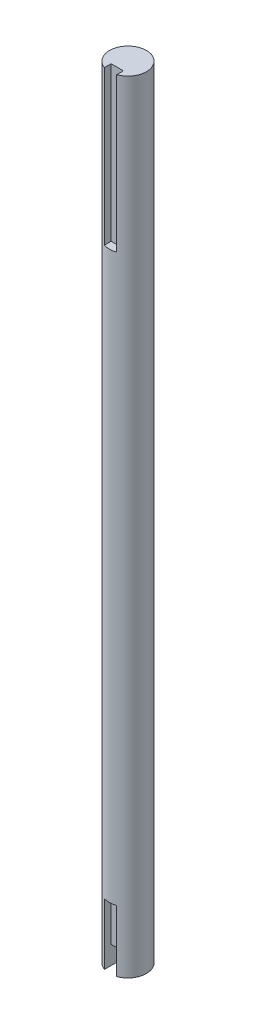
ISO-10303-21;
HEADER;
FILE_DESCRIPTION(('STEP AP214'),'2;1');
FILE_NAME('part.step','',(''),(''),'','','');
FILE_SCHEMA(('AUTOMOTIVE_DESIGN { 1 0 10303 214 1 1 1 1 }'));
ENDSEC;
DATA;
#1=APPLICATION_CONTEXT('core data for automotive mechanical design processes');
#2=APPLICATION_PROTOCOL_DEFINITION('international standard','automotive_design',2000,#1);
#3=PRODUCT_CONTEXT('',#1,'mechanical');
#4=PRODUCT('Part','Part','',(#3));
#5=PRODUCT_RELATED_PRODUCT_CATEGORY('part','',(#4));
#6=PRODUCT_DEFINITION_FORMATION('','',#4);
#7=PRODUCT_DEFINITION_CONTEXT('part definition',#1,'design');
#8=PRODUCT_DEFINITION('design','',#6,#7);
#9=PRODUCT_DEFINITION_SHAPE('','',#8);
#10=(LENGTH_UNIT() NAMED_UNIT(*) SI_UNIT(.MILLI.,.METRE.));
#11=(NAMED_UNIT(*) PLANE_ANGLE_UNIT() SI_UNIT($,.RADIAN.));
#12=(NAMED_UNIT(*) SI_UNIT($,.STERADIAN.) SOLID_ANGLE_UNIT());
#13=UNCERTAINTY_MEASURE_WITH_UNIT(LENGTH_MEASURE(1.E-05),#10,'distance_accuracy_value','');
#14=(GEOMETRIC_REPRESENTATION_CONTEXT(3) GLOBAL_UNCERTAINTY_ASSIGNED_CONTEXT((#13)) GLOBAL_UNIT_ASSIGNED_CONTEXT((#10,
#11,#12)) REPRESENTATION_CONTEXT('',''));
#15=CARTESIAN_POINT('',(0.,0.,0.));
#16=DIRECTION('',(0.,0.,1.));
#17=DIRECTION('',(1.,0.,0.));
#18=AXIS2_PLACEMENT_3D('',#15,#16,#17);
#19=CARTESIAN_POINT('',(0.,0.,0.));
#20=DIRECTION('',(0.,1.,0.));
#21=DIRECTION('',(0.,0.,1.));
#22=AXIS2_PLACEMENT_3D('',#19,#20,#21);
#23=PLANE('',#22);
#24=DIRECTION('',(0.,0.,1.));
#25=VECTOR('',#24,1.);
#26=CARTESIAN_POINT('',(2.,0.,0.));
#27=LINE('',#26,#25);
#28=CARTESIAN_POINT('',(2.,0.,1.));
#29=VERTEX_POINT('',#28);
#30=CARTESIAN_POINT('',(2.,0.,5.65685424949238));
#31=VERTEX_POINT('',#30);
#32=EDGE_CURVE('E185',#29,#31,#27,.T.);
#33=ORIENTED_EDGE('',*,*,#32,.F.);
#34=DIRECTION('',(-1.,0.,0.));
#35=VECTOR('',#34,1.);
#36=CARTESIAN_POINT('',(-2.,0.,0.999999999999999));
#37=LINE('',#36,#35);
#38=CARTESIAN_POINT('',(-2.,0.,0.999999999999999));
#39=VERTEX_POINT('',#38);
#40=EDGE_CURVE('E123',#29,#39,#37,.T.);
#41=ORIENTED_EDGE('',*,*,#40,.T.);
#42=DIRECTION('',(0.,0.,-1.));
#43=VECTOR('',#42,1.);
#44=CARTESIAN_POINT('',(-2.,0.,0.));
#45=LINE('',#44,#43);
#46=CARTESIAN_POINT('',(-2.,0.,5.65685424949238));
#47=VERTEX_POINT('',#46);
#48=EDGE_CURVE('E181',#47,#39,#45,.T.);
#49=ORIENTED_EDGE('',*,*,#48,.F.);
#50=CARTESIAN_POINT('',(0.,0.,0.));
#51=DIRECTION('',(0.,1.,0.));
#52=DIRECTION('',(0.,0.,1.));
#53=AXIS2_PLACEMENT_3D('',#50,#51,#52);
#54=CIRCLE('',#53,6.);
#55=EDGE_CURVE('E177',#31,#47,#54,.T.);
#56=ORIENTED_EDGE('',*,*,#55,.F.);
#57=EDGE_LOOP('',(#33,#41,#49,#56));
#58=FACE_BOUND('',#57,.T.);
#59=ADVANCED_FACE('F38',(#58),#23,.F.);
#60=CARTESIAN_POINT('',(-2.,20.,3.5));
#61=DIRECTION('',(0.,0.,1.));
#62=DIRECTION('',(1.,0.,0.));
#63=AXIS2_PLACEMENT_3D('',#60,#61,#62);
#64=PLANE('',#63);
#65=DIRECTION('',(0.,-1.,0.));
#66=VECTOR('',#65,1.);
#67=CARTESIAN_POINT('',(-2.,20.,3.5));
#68=LINE('',#67,#66);
#69=CARTESIAN_POINT('',(-2.,20.,3.5));
#70=VERTEX_POINT('',#69);
#71=CARTESIAN_POINT('',(-2.,6.,3.5));
#72=VERTEX_POINT('',#71);
#73=EDGE_CURVE('E169',#70,#72,#68,.T.);
#74=ORIENTED_EDGE('',*,*,#73,.T.);
#75=DIRECTION('',(1.,0.,0.));
#76=VECTOR('',#75,1.);
#77=CARTESIAN_POINT('',(-2.,6.,3.5));
#78=LINE('',#77,#76);
#79=CARTESIAN_POINT('',(2.,6.,3.5));
#80=VERTEX_POINT('',#79);
#81=EDGE_CURVE('E136',#72,#80,#78,.T.);
#82=ORIENTED_EDGE('',*,*,#81,.T.);
#83=DIRECTION('',(0.,-1.,0.));
#84=VECTOR('',#83,1.);
#85=CARTESIAN_POINT('',(2.,20.,3.5));
#86=LINE('',#85,#84);
#87=CARTESIAN_POINT('',(2.,20.,3.5));
#88=VERTEX_POINT('',#87);
#89=EDGE_CURVE('E121',#88,#80,#86,.T.);
#90=ORIENTED_EDGE('',*,*,#89,.F.);
#91=DIRECTION('',(-1.,0.,0.));
#92=VECTOR('',#91,1.);
#93=CARTESIAN_POINT('',(-2.,20.,3.5));
#94=LINE('',#93,#92);
#95=EDGE_CURVE('E164',#88,#70,#94,.T.);
#96=ORIENTED_EDGE('',*,*,#95,.T.);
#97=EDGE_LOOP('',(#74,#82,#90,#96));
#98=FACE_BOUND('',#97,.T.);
#99=ADVANCED_FACE('F217',(#98),#64,.T.);
#100=CARTESIAN_POINT('',(0.,254.,0.));
#101=DIRECTION('',(0.,-1.,0.));
#102=DIRECTION('',(0.,0.,-1.));
#103=AXIS2_PLACEMENT_3D('',#100,#101,#102);
#104=CYLINDRICAL_SURFACE('',#103,6.);
#105=DIRECTION('',(0.,-1.,0.));
#106=VECTOR('',#105,1.);
#107=CARTESIAN_POINT('',(2.,254.,5.65685424949238));
#108=LINE('',#107,#106);
#109=CARTESIAN_POINT('',(2.,20.,5.65685424949238));
#110=VERTEX_POINT('',#109);
#111=EDGE_CURVE('E175',#31,#110,#108,.F.);
#112=ORIENTED_EDGE('',*,*,#111,.F.);
#113=ORIENTED_EDGE('',*,*,#55,.T.);
#114=DIRECTION('',(0.,-1.,0.));
#115=VECTOR('',#114,1.);
#116=CARTESIAN_POINT('',(-2.,254.,5.65685424949238));
#117=LINE('',#116,#115);
#118=CARTESIAN_POINT('',(-2.,20.,5.65685424949238));
#119=VERTEX_POINT('',#118);
#120=EDGE_CURVE('E173',#119,#47,#117,.T.);
#121=ORIENTED_EDGE('',*,*,#120,.F.);
#122=CARTESIAN_POINT('',(0.,20.,0.));
#123=DIRECTION('',(0.,-1.,0.));
#124=DIRECTION('',(0.,0.,-1.));
#125=AXIS2_PLACEMENT_3D('',#122,#123,#124);
#126=CIRCLE('',#125,6.);
#127=EDGE_CURVE('E187',#110,#119,#126,.T.);
#128=ORIENTED_EDGE('',*,*,#127,.F.);
#129=EDGE_LOOP('',(#112,#113,#121,#128));
#130=FACE_BOUND('',#129,.T.);
#131=DIRECTION('',(0.,-1.,0.));
#132=VECTOR('',#131,1.);
#133=CARTESIAN_POINT('',(-2.,254.,5.65685424949238));
#134=LINE('',#133,#132);
#135=CARTESIAN_POINT('',(-2.,254.,5.65685424949238));
#136=VERTEX_POINT('',#135);
#137=CARTESIAN_POINT('',(-2.,204.,5.65685424949238));
#138=VERTEX_POINT('',#137);
#139=EDGE_CURVE('E160',#136,#138,#134,.T.);
#140=ORIENTED_EDGE('',*,*,#139,.F.);
#141=CARTESIAN_POINT('',(0.,254.,0.));
#142=DIRECTION('',(0.,1.,0.));
#143=DIRECTION('',(0.,0.,1.));
#144=AXIS2_PLACEMENT_3D('',#141,#142,#143);
#145=CIRCLE('',#144,6.);
#146=CARTESIAN_POINT('',(2.,254.,5.65685424949238));
#147=VERTEX_POINT('',#146);
#148=EDGE_CURVE('E178',#147,#136,#145,.T.);
#149=ORIENTED_EDGE('',*,*,#148,.F.);
#150=DIRECTION('',(0.,-1.,0.));
#151=VECTOR('',#150,1.);
#152=CARTESIAN_POINT('',(2.,254.,5.65685424949238));
#153=LINE('',#152,#151);
#154=CARTESIAN_POINT('',(2.,204.,5.65685424949238));
#155=VERTEX_POINT('',#154);
#156=EDGE_CURVE('E61',#155,#147,#153,.F.);
#157=ORIENTED_EDGE('',*,*,#156,.F.);
#158=CARTESIAN_POINT('',(0.,204.,0.));
#159=DIRECTION('',(0.,-1.,0.));
#160=DIRECTION('',(0.,0.,-1.));
#161=AXIS2_PLACEMENT_3D('',#158,#159,#160);
#162=CIRCLE('',#161,6.);
#163=EDGE_CURVE('E11',#155,#138,#162,.T.);
#164=ORIENTED_EDGE('',*,*,#163,.T.);
#165=EDGE_LOOP('',(#140,#149,#157,#164));
#166=FACE_BOUND('',#165,.T.);
#167=ADVANCED_FACE('F40',(#130,#166),#104,.T.);
#168=CARTESIAN_POINT('',(0.,254.,0.));
#169=DIRECTION('',(0.,1.,0.));
#170=DIRECTION('',(0.,0.,1.));
#171=AXIS2_PLACEMENT_3D('',#168,#169,#170);
#172=PLANE('',#171);
#173=ORIENTED_EDGE('',*,*,#148,.T.);
#174=DIRECTION('',(0.,0.,-1.));
#175=VECTOR('',#174,1.);
#176=CARTESIAN_POINT('',(-2.,254.,0.));
#177=LINE('',#176,#175);
#178=CARTESIAN_POINT('',(-2.,254.,3.5));
#179=VERTEX_POINT('',#178);
#180=EDGE_CURVE('E46',#136,#179,#177,.T.);
#181=ORIENTED_EDGE('',*,*,#180,.T.);
#182=DIRECTION('',(1.,0.,0.));
#183=VECTOR('',#182,1.);
#184=CARTESIAN_POINT('',(0.,254.,3.5));
#185=LINE('',#184,#183);
#186=CARTESIAN_POINT('',(2.,254.,3.5));
#187=VERTEX_POINT('',#186);
#188=EDGE_CURVE('E139',#179,#187,#185,.T.);
#189=ORIENTED_EDGE('',*,*,#188,.T.);
#190=DIRECTION('',(0.,0.,1.));
#191=VECTOR('',#190,1.);
#192=CARTESIAN_POINT('',(2.,254.,0.));
#193=LINE('',#192,#191);
#194=EDGE_CURVE('E147',#187,#147,#193,.T.);
#195=ORIENTED_EDGE('',*,*,#194,.T.);
#196=EDGE_LOOP('',(#173,#181,#189,#195));
#197=FACE_BOUND('',#196,.T.);
#198=ADVANCED_FACE('F190',(#197),#172,.T.);
#199=CARTESIAN_POINT('',(0.,20.,0.));
#200=DIRECTION('',(0.,-1.,0.));
#201=DIRECTION('',(0.,0.,-1.));
#202=AXIS2_PLACEMENT_3D('',#199,#200,#201);
#203=PLANE('',#202);
#204=ORIENTED_EDGE('',*,*,#127,.T.);
#205=DIRECTION('',(0.,0.,1.));
#206=VECTOR('',#205,1.);
#207=CARTESIAN_POINT('',(-2.,20.,8.5));
#208=LINE('',#207,#206);
#209=EDGE_CURVE('E166',#70,#119,#208,.T.);
#210=ORIENTED_EDGE('',*,*,#209,.F.);
#211=ORIENTED_EDGE('',*,*,#95,.F.);
#212=DIRECTION('',(0.,0.,-1.));
#213=VECTOR('',#212,1.);
#214=CARTESIAN_POINT('',(2.,20.,8.5));
#215=LINE('',#214,#213);
#216=EDGE_CURVE('E162',#110,#88,#215,.T.);
#217=ORIENTED_EDGE('',*,*,#216,.F.);
#218=EDGE_LOOP('',(#204,#210,#211,#217));
#219=FACE_BOUND('',#218,.T.);
#220=ADVANCED_FACE('F227',(#219),#203,.T.);
#221=CARTESIAN_POINT('',(2.,20.,8.5));
#222=DIRECTION('',(-1.,0.,0.));
#223=DIRECTION('',(0.,0.,1.));
#224=AXIS2_PLACEMENT_3D('',#221,#222,#223);
#225=PLANE('',#224);
#226=ORIENTED_EDGE('',*,*,#111,.T.);
#227=ORIENTED_EDGE('',*,*,#216,.T.);
#228=ORIENTED_EDGE('',*,*,#89,.T.);
#229=DIRECTION('',(0.,0.,-1.));
#230=VECTOR('',#229,1.);
#231=CARTESIAN_POINT('',(2.,6.,11.));
#232=LINE('',#231,#230);
#233=CARTESIAN_POINT('',(2.,6.,1.));
#234=VERTEX_POINT('',#233);
#235=EDGE_CURVE('E53',#80,#234,#232,.T.);
#236=ORIENTED_EDGE('',*,*,#235,.T.);
#237=DIRECTION('',(0.,-1.,0.));
#238=VECTOR('',#237,1.);
#239=CARTESIAN_POINT('',(2.,6.,1.));
#240=LINE('',#239,#238);
#241=EDGE_CURVE('E119',#234,#29,#240,.T.);
#242=ORIENTED_EDGE('',*,*,#241,.T.);
#243=ORIENTED_EDGE('',*,*,#32,.T.);
#244=EDGE_LOOP('',(#226,#227,#228,#236,#242,#243));
#245=FACE_BOUND('',#244,.T.);
#246=ADVANCED_FACE('F117',(#245),#225,.T.);
#247=CARTESIAN_POINT('',(-2.,20.,8.5));
#248=DIRECTION('',(1.,0.,0.));
#249=DIRECTION('',(0.,0.,-1.));
#250=AXIS2_PLACEMENT_3D('',#247,#248,#249);
#251=PLANE('',#250);
#252=ORIENTED_EDGE('',*,*,#48,.T.);
#253=DIRECTION('',(0.,-1.,0.));
#254=VECTOR('',#253,1.);
#255=CARTESIAN_POINT('',(-2.,6.,0.999999999999999));
#256=LINE('',#255,#254);
#257=CARTESIAN_POINT('',(-2.,6.,0.999999999999999));
#258=VERTEX_POINT('',#257);
#259=EDGE_CURVE('E137',#258,#39,#256,.T.);
#260=ORIENTED_EDGE('',*,*,#259,.F.);
#261=DIRECTION('',(0.,0.,1.));
#262=VECTOR('',#261,1.);
#263=CARTESIAN_POINT('',(-2.,6.,11.));
#264=LINE('',#263,#262);
#265=EDGE_CURVE('E128',#258,#72,#264,.T.);
#266=ORIENTED_EDGE('',*,*,#265,.T.);
#267=ORIENTED_EDGE('',*,*,#73,.F.);
#268=ORIENTED_EDGE('',*,*,#209,.T.);
#269=ORIENTED_EDGE('',*,*,#120,.T.);
#270=EDGE_LOOP('',(#252,#260,#266,#267,#268,#269));
#271=FACE_BOUND('',#270,.T.);
#272=ADVANCED_FACE('F229',(#271),#251,.T.);
#273=CARTESIAN_POINT('',(0.,204.,0.));
#274=DIRECTION('',(0.,-1.,0.));
#275=DIRECTION('',(0.,0.,-1.));
#276=AXIS2_PLACEMENT_3D('',#273,#274,#275);
#277=PLANE('',#276);
#278=DIRECTION('',(0.,0.,1.));
#279=VECTOR('',#278,1.);
#280=CARTESIAN_POINT('',(2.,204.,0.));
#281=LINE('',#280,#279);
#282=CARTESIAN_POINT('',(2.,204.,3.5));
#283=VERTEX_POINT('',#282);
#284=EDGE_CURVE('E149',#283,#155,#281,.T.);
#285=ORIENTED_EDGE('',*,*,#284,.F.);
#286=DIRECTION('',(1.,0.,0.));
#287=VECTOR('',#286,1.);
#288=CARTESIAN_POINT('',(0.,204.,3.5));
#289=LINE('',#288,#287);
#290=CARTESIAN_POINT('',(-2.,204.,3.5));
#291=VERTEX_POINT('',#290);
#292=EDGE_CURVE('E146',#291,#283,#289,.T.);
#293=ORIENTED_EDGE('',*,*,#292,.F.);
#294=DIRECTION('',(0.,0.,-1.));
#295=VECTOR('',#294,1.);
#296=CARTESIAN_POINT('',(-2.,204.,0.));
#297=LINE('',#296,#295);
#298=EDGE_CURVE('E144',#138,#291,#297,.T.);
#299=ORIENTED_EDGE('',*,*,#298,.F.);
#300=ORIENTED_EDGE('',*,*,#163,.F.);
#301=EDGE_LOOP('',(#285,#293,#299,#300));
#302=FACE_BOUND('',#301,.T.);
#303=ADVANCED_FACE('F200',(#302),#277,.F.);
#304=CARTESIAN_POINT('',(-2.,204.,0.));
#305=DIRECTION('',(1.,0.,0.));
#306=DIRECTION('',(0.,0.,-1.));
#307=AXIS2_PLACEMENT_3D('',#304,#305,#306);
#308=PLANE('',#307);
#309=ORIENTED_EDGE('',*,*,#139,.T.);
#310=ORIENTED_EDGE('',*,*,#298,.T.);
#311=DIRECTION('',(0.,1.,0.));
#312=VECTOR('',#311,1.);
#313=CARTESIAN_POINT('',(-2.,204.,3.5));
#314=LINE('',#313,#312);
#315=EDGE_CURVE('E156',#291,#179,#314,.T.);
#316=ORIENTED_EDGE('',*,*,#315,.T.);
#317=ORIENTED_EDGE('',*,*,#180,.F.);
#318=EDGE_LOOP('',(#309,#310,#316,#317));
#319=FACE_BOUND('',#318,.T.);
#320=ADVANCED_FACE('F194',(#319),#308,.T.);
#321=CARTESIAN_POINT('',(2.,204.,0.));
#322=DIRECTION('',(-1.,0.,0.));
#323=DIRECTION('',(0.,0.,1.));
#324=AXIS2_PLACEMENT_3D('',#321,#322,#323);
#325=PLANE('',#324);
#326=ORIENTED_EDGE('',*,*,#156,.T.);
#327=ORIENTED_EDGE('',*,*,#194,.F.);
#328=DIRECTION('',(0.,1.,0.));
#329=VECTOR('',#328,1.);
#330=CARTESIAN_POINT('',(2.,204.,3.5));
#331=LINE('',#330,#329);
#332=EDGE_CURVE('E151',#283,#187,#331,.T.);
#333=ORIENTED_EDGE('',*,*,#332,.F.);
#334=ORIENTED_EDGE('',*,*,#284,.T.);
#335=EDGE_LOOP('',(#326,#327,#333,#334));
#336=FACE_BOUND('',#335,.T.);
#337=ADVANCED_FACE('F203',(#336),#325,.T.);
#338=CARTESIAN_POINT('',(0.,204.,3.5));
#339=DIRECTION('',(0.,0.,1.));
#340=DIRECTION('',(1.,0.,0.));
#341=AXIS2_PLACEMENT_3D('',#338,#339,#340);
#342=PLANE('',#341);
#343=ORIENTED_EDGE('',*,*,#188,.F.);
#344=ORIENTED_EDGE('',*,*,#315,.F.);
#345=ORIENTED_EDGE('',*,*,#292,.T.);
#346=ORIENTED_EDGE('',*,*,#332,.T.);
#347=EDGE_LOOP('',(#343,#344,#345,#346));
#348=FACE_BOUND('',#347,.T.);
#349=ADVANCED_FACE('F205',(#348),#342,.T.);
#350=CARTESIAN_POINT('',(-2.,6.,0.999999999999999));
#351=DIRECTION('',(0.,0.,1.));
#352=DIRECTION('',(1.,0.,0.));
#353=AXIS2_PLACEMENT_3D('',#350,#351,#352);
#354=PLANE('',#353);
#355=ORIENTED_EDGE('',*,*,#40,.F.);
#356=ORIENTED_EDGE('',*,*,#241,.F.);
#357=DIRECTION('',(-1.,0.,0.));
#358=VECTOR('',#357,1.);
#359=CARTESIAN_POINT('',(-2.,6.,0.999999999999999));
#360=LINE('',#359,#358);
#361=EDGE_CURVE('E122',#234,#258,#360,.T.);
#362=ORIENTED_EDGE('',*,*,#361,.T.);
#363=ORIENTED_EDGE('',*,*,#259,.T.);
#364=EDGE_LOOP('',(#355,#356,#362,#363));
#365=FACE_BOUND('',#364,.T.);
#366=ADVANCED_FACE('F134',(#365),#354,.T.);
#367=CARTESIAN_POINT('',(0.,6.,0.));
#368=DIRECTION('',(0.,-1.,0.));
#369=DIRECTION('',(0.,0.,-1.));
#370=AXIS2_PLACEMENT_3D('',#367,#368,#369);
#371=PLANE('',#370);
#372=ORIENTED_EDGE('',*,*,#265,.F.);
#373=ORIENTED_EDGE('',*,*,#361,.F.);
#374=ORIENTED_EDGE('',*,*,#235,.F.);
#375=ORIENTED_EDGE('',*,*,#81,.F.);
#376=EDGE_LOOP('',(#372,#373,#374,#375));
#377=FACE_BOUND('',#376,.T.);
#378=ADVANCED_FACE('F126',(#377),#371,.T.);
#379=CLOSED_SHELL('',(#59,#99,#167,#198,#220,#246,#272,#303,#320,#337,#349,#366,#378));
#380=MANIFOLD_SOLID_BREP('B2',#379);
#381=ADVANCED_BREP_SHAPE_REPRESENTATION('',(#18,#380),#14);
#382=SHAPE_DEFINITION_REPRESENTATION(#9,#381);
ENDSEC;
END-ISO-10303-21;
